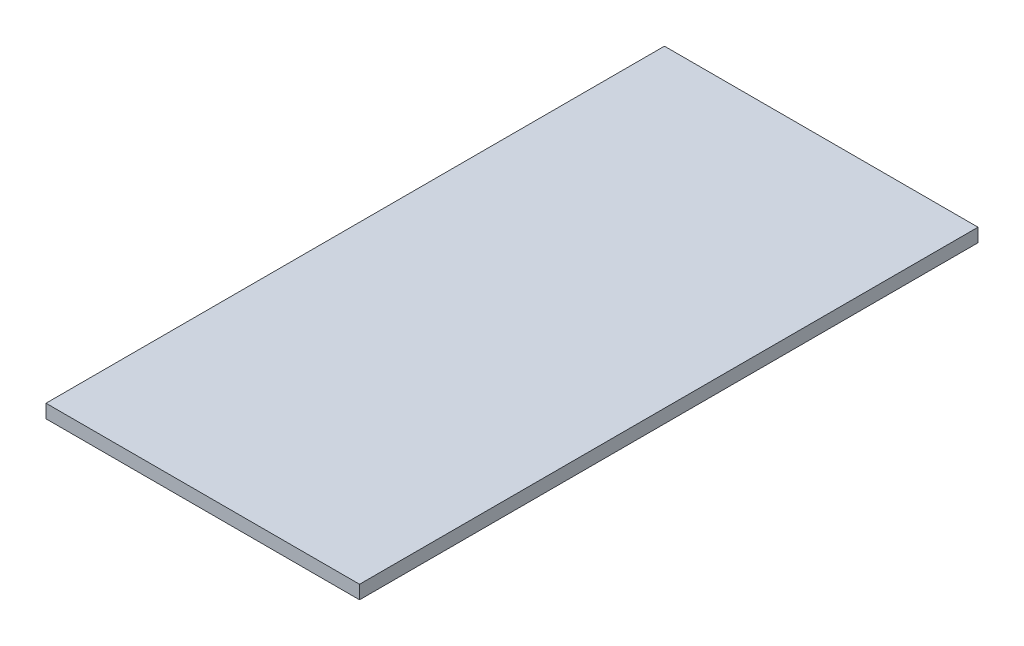
ISO-10303-21;
HEADER;
FILE_DESCRIPTION(('STEP AP214'),'2;1');
FILE_NAME('part.step','',(''),(''),'','','');
FILE_SCHEMA(('AUTOMOTIVE_DESIGN { 1 0 10303 214 1 1 1 1 }'));
ENDSEC;
DATA;
#1=APPLICATION_CONTEXT('core data for automotive mechanical design processes');
#2=APPLICATION_PROTOCOL_DEFINITION('international standard','automotive_design',2000,#1);
#3=PRODUCT_CONTEXT('',#1,'mechanical');
#4=PRODUCT('Part','Part','',(#3));
#5=PRODUCT_RELATED_PRODUCT_CATEGORY('part','',(#4));
#6=PRODUCT_DEFINITION_FORMATION('','',#4);
#7=PRODUCT_DEFINITION_CONTEXT('part definition',#1,'design');
#8=PRODUCT_DEFINITION('design','',#6,#7);
#9=PRODUCT_DEFINITION_SHAPE('','',#8);
#10=(LENGTH_UNIT() NAMED_UNIT(*) SI_UNIT(.MILLI.,.METRE.));
#11=(NAMED_UNIT(*) PLANE_ANGLE_UNIT() SI_UNIT($,.RADIAN.));
#12=(NAMED_UNIT(*) SI_UNIT($,.STERADIAN.) SOLID_ANGLE_UNIT());
#13=UNCERTAINTY_MEASURE_WITH_UNIT(LENGTH_MEASURE(1.E-05),#10,'distance_accuracy_value','');
#14=(GEOMETRIC_REPRESENTATION_CONTEXT(3) GLOBAL_UNCERTAINTY_ASSIGNED_CONTEXT((#13)) GLOBAL_UNIT_ASSIGNED_CONTEXT((#10,
#11,#12)) REPRESENTATION_CONTEXT('',''));
#15=CARTESIAN_POINT('',(0.,0.,0.));
#16=DIRECTION('',(0.,0.,1.));
#17=DIRECTION('',(1.,0.,0.));
#18=AXIS2_PLACEMENT_3D('',#15,#16,#17);
#19=CARTESIAN_POINT('',(36.83,3.175,72.644));
#20=DIRECTION('',(-1.,0.,0.));
#21=DIRECTION('',(0.,0.,1.));
#22=AXIS2_PLACEMENT_3D('',#19,#20,#21);
#23=PLANE('',#22);
#24=DIRECTION('',(0.,0.,-1.));
#25=VECTOR('',#24,1.);
#26=CARTESIAN_POINT('',(36.83,0.,72.644));
#27=LINE('',#26,#25);
#28=CARTESIAN_POINT('',(36.83,0.,72.644));
#29=VERTEX_POINT('',#28);
#30=CARTESIAN_POINT('',(36.83,0.,-72.644));
#31=VERTEX_POINT('',#30);
#32=EDGE_CURVE('E109',#29,#31,#27,.T.);
#33=ORIENTED_EDGE('',*,*,#32,.T.);
#34=DIRECTION('',(0.,-1.,0.));
#35=VECTOR('',#34,1.);
#36=CARTESIAN_POINT('',(36.83,3.175,-72.644));
#37=LINE('',#36,#35);
#38=CARTESIAN_POINT('',(36.83,3.175,-72.644));
#39=VERTEX_POINT('',#38);
#40=EDGE_CURVE('E11',#39,#31,#37,.T.);
#41=ORIENTED_EDGE('',*,*,#40,.F.);
#42=DIRECTION('',(0.,0.,-1.));
#43=VECTOR('',#42,1.);
#44=CARTESIAN_POINT('',(36.83,3.175,72.644));
#45=LINE('',#44,#43);
#46=CARTESIAN_POINT('',(36.83,3.175,72.644));
#47=VERTEX_POINT('',#46);
#48=EDGE_CURVE('E93',#47,#39,#45,.T.);
#49=ORIENTED_EDGE('',*,*,#48,.F.);
#50=DIRECTION('',(0.,-1.,0.));
#51=VECTOR('',#50,1.);
#52=CARTESIAN_POINT('',(36.83,3.175,72.644));
#53=LINE('',#52,#51);
#54=EDGE_CURVE('E105',#47,#29,#53,.T.);
#55=ORIENTED_EDGE('',*,*,#54,.T.);
#56=EDGE_LOOP('',(#33,#41,#49,#55));
#57=FACE_BOUND('',#56,.T.);
#58=ADVANCED_FACE('F41',(#57),#23,.F.);
#59=CARTESIAN_POINT('',(-36.83,3.175,-72.644));
#60=DIRECTION('',(0.,0.,1.));
#61=DIRECTION('',(1.,0.,0.));
#62=AXIS2_PLACEMENT_3D('',#59,#60,#61);
#63=PLANE('',#62);
#64=DIRECTION('',(-1.,0.,0.));
#65=VECTOR('',#64,1.);
#66=CARTESIAN_POINT('',(-36.83,0.,-72.644));
#67=LINE('',#66,#65);
#68=CARTESIAN_POINT('',(-36.83,0.,-72.644));
#69=VERTEX_POINT('',#68);
#70=EDGE_CURVE('E98',#31,#69,#67,.T.);
#71=ORIENTED_EDGE('',*,*,#70,.T.);
#72=DIRECTION('',(0.,-1.,0.));
#73=VECTOR('',#72,1.);
#74=CARTESIAN_POINT('',(-36.83,3.175,-72.644));
#75=LINE('',#74,#73);
#76=CARTESIAN_POINT('',(-36.83,3.175,-72.644));
#77=VERTEX_POINT('',#76);
#78=EDGE_CURVE('E50',#77,#69,#75,.T.);
#79=ORIENTED_EDGE('',*,*,#78,.F.);
#80=DIRECTION('',(-1.,0.,0.));
#81=VECTOR('',#80,1.);
#82=CARTESIAN_POINT('',(-36.83,3.175,-72.644));
#83=LINE('',#82,#81);
#84=EDGE_CURVE('E88',#39,#77,#83,.T.);
#85=ORIENTED_EDGE('',*,*,#84,.F.);
#86=ORIENTED_EDGE('',*,*,#40,.T.);
#87=EDGE_LOOP('',(#71,#79,#85,#86));
#88=FACE_BOUND('',#87,.T.);
#89=ADVANCED_FACE('F97',(#88),#63,.F.);
#90=CARTESIAN_POINT('',(-36.83,3.175,72.644));
#91=DIRECTION('',(1.,0.,0.));
#92=DIRECTION('',(0.,0.,-1.));
#93=AXIS2_PLACEMENT_3D('',#90,#91,#92);
#94=PLANE('',#93);
#95=DIRECTION('',(0.,0.,1.));
#96=VECTOR('',#95,1.);
#97=CARTESIAN_POINT('',(-36.83,0.,72.644));
#98=LINE('',#97,#96);
#99=CARTESIAN_POINT('',(-36.83,0.,72.644));
#100=VERTEX_POINT('',#99);
#101=EDGE_CURVE('E75',#69,#100,#98,.T.);
#102=ORIENTED_EDGE('',*,*,#101,.T.);
#103=DIRECTION('',(0.,-1.,0.));
#104=VECTOR('',#103,1.);
#105=CARTESIAN_POINT('',(-36.83,3.175,72.644));
#106=LINE('',#105,#104);
#107=CARTESIAN_POINT('',(-36.83,3.175,72.644));
#108=VERTEX_POINT('',#107);
#109=EDGE_CURVE('E100',#108,#100,#106,.T.);
#110=ORIENTED_EDGE('',*,*,#109,.F.);
#111=DIRECTION('',(0.,0.,1.));
#112=VECTOR('',#111,1.);
#113=CARTESIAN_POINT('',(-36.83,3.175,72.644));
#114=LINE('',#113,#112);
#115=EDGE_CURVE('E91',#77,#108,#114,.T.);
#116=ORIENTED_EDGE('',*,*,#115,.F.);
#117=ORIENTED_EDGE('',*,*,#78,.T.);
#118=EDGE_LOOP('',(#102,#110,#116,#117));
#119=FACE_BOUND('',#118,.T.);
#120=ADVANCED_FACE('F101',(#119),#94,.F.);
#121=CARTESIAN_POINT('',(-36.83,3.175,72.644));
#122=DIRECTION('',(0.,0.,-1.));
#123=DIRECTION('',(-1.,0.,0.));
#124=AXIS2_PLACEMENT_3D('',#121,#122,#123);
#125=PLANE('',#124);
#126=DIRECTION('',(1.,0.,0.));
#127=VECTOR('',#126,1.);
#128=CARTESIAN_POINT('',(-36.83,0.,72.644));
#129=LINE('',#128,#127);
#130=EDGE_CURVE('E81',#100,#29,#129,.T.);
#131=ORIENTED_EDGE('',*,*,#130,.T.);
#132=ORIENTED_EDGE('',*,*,#54,.F.);
#133=DIRECTION('',(1.,0.,0.));
#134=VECTOR('',#133,1.);
#135=CARTESIAN_POINT('',(-36.83,3.175,72.644));
#136=LINE('',#135,#134);
#137=EDGE_CURVE('E58',#108,#47,#136,.T.);
#138=ORIENTED_EDGE('',*,*,#137,.F.);
#139=ORIENTED_EDGE('',*,*,#109,.T.);
#140=EDGE_LOOP('',(#131,#132,#138,#139));
#141=FACE_BOUND('',#140,.T.);
#142=ADVANCED_FACE('F122',(#141),#125,.F.);
#143=CARTESIAN_POINT('',(0.,3.175,0.));
#144=DIRECTION('',(0.,-1.,0.));
#145=DIRECTION('',(0.,0.,-1.));
#146=AXIS2_PLACEMENT_3D('',#143,#144,#145);
#147=PLANE('',#146);
#148=ORIENTED_EDGE('',*,*,#48,.T.);
#149=ORIENTED_EDGE('',*,*,#84,.T.);
#150=ORIENTED_EDGE('',*,*,#115,.T.);
#151=ORIENTED_EDGE('',*,*,#137,.T.);
#152=EDGE_LOOP('',(#148,#149,#150,#151));
#153=FACE_BOUND('',#152,.T.);
#154=ADVANCED_FACE('F89',(#153),#147,.F.);
#155=CARTESIAN_POINT('',(0.,0.,0.));
#156=DIRECTION('',(0.,-1.,0.));
#157=DIRECTION('',(0.,0.,-1.));
#158=AXIS2_PLACEMENT_3D('',#155,#156,#157);
#159=PLANE('',#158);
#160=ORIENTED_EDGE('',*,*,#32,.F.);
#161=ORIENTED_EDGE('',*,*,#130,.F.);
#162=ORIENTED_EDGE('',*,*,#101,.F.);
#163=ORIENTED_EDGE('',*,*,#70,.F.);
#164=EDGE_LOOP('',(#160,#161,#162,#163));
#165=FACE_BOUND('',#164,.T.);
#166=ADVANCED_FACE('F125',(#165),#159,.T.);
#167=CLOSED_SHELL('',(#58,#89,#120,#142,#154,#166));
#168=MANIFOLD_SOLID_BREP('B2',#167);
#169=ADVANCED_BREP_SHAPE_REPRESENTATION('',(#18,#168),#14);
#170=SHAPE_DEFINITION_REPRESENTATION(#9,#169);
ENDSEC;
END-ISO-10303-21;
